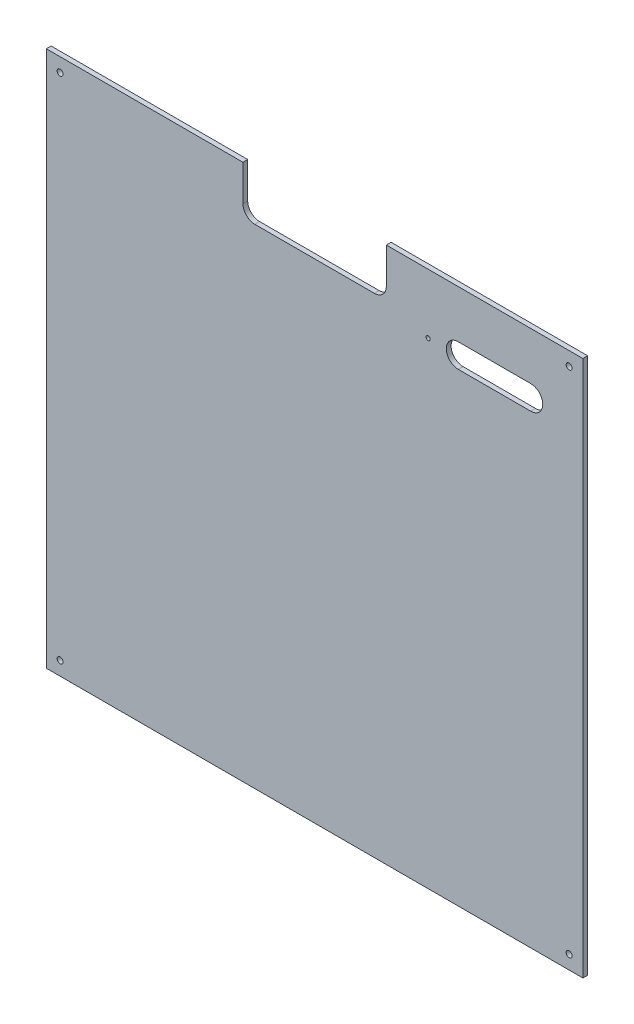
ISO-10303-21;
HEADER;
FILE_DESCRIPTION(('STEP AP214'),'2;1');
FILE_NAME('part.step','',(''),(''),'','','');
FILE_SCHEMA(('AUTOMOTIVE_DESIGN { 1 0 10303 214 1 1 1 1 }'));
ENDSEC;
DATA;
#1=APPLICATION_CONTEXT('core data for automotive mechanical design processes');
#2=APPLICATION_PROTOCOL_DEFINITION('international standard','automotive_design',2000,#1);
#3=PRODUCT_CONTEXT('',#1,'mechanical');
#4=PRODUCT('Part','Part','',(#3));
#5=PRODUCT_RELATED_PRODUCT_CATEGORY('part','',(#4));
#6=PRODUCT_DEFINITION_FORMATION('','',#4);
#7=PRODUCT_DEFINITION_CONTEXT('part definition',#1,'design');
#8=PRODUCT_DEFINITION('design','',#6,#7);
#9=PRODUCT_DEFINITION_SHAPE('','',#8);
#10=(LENGTH_UNIT() NAMED_UNIT(*) SI_UNIT(.MILLI.,.METRE.));
#11=(NAMED_UNIT(*) PLANE_ANGLE_UNIT() SI_UNIT($,.RADIAN.));
#12=(NAMED_UNIT(*) SI_UNIT($,.STERADIAN.) SOLID_ANGLE_UNIT());
#13=UNCERTAINTY_MEASURE_WITH_UNIT(LENGTH_MEASURE(1.E-05),#10,'distance_accuracy_value','');
#14=(GEOMETRIC_REPRESENTATION_CONTEXT(3) GLOBAL_UNCERTAINTY_ASSIGNED_CONTEXT((#13)) GLOBAL_UNIT_ASSIGNED_CONTEXT((#10,
#11,#12)) REPRESENTATION_CONTEXT('',''));
#15=CARTESIAN_POINT('',(0.,0.,0.));
#16=DIRECTION('',(0.,0.,1.));
#17=DIRECTION('',(1.,0.,0.));
#18=AXIS2_PLACEMENT_3D('',#15,#16,#17);
#19=CARTESIAN_POINT('',(174.5,419.,4.));
#20=DIRECTION('',(0.,0.,1.));
#21=DIRECTION('',(1.,0.,0.));
#22=AXIS2_PLACEMENT_3D('',#19,#20,#21);
#23=PLANE('',#22);
#24=DIRECTION('',(1.,0.,0.));
#25=VECTOR('',#24,1.);
#26=CARTESIAN_POINT('',(344.715899344631,389.,4.));
#27=LINE('',#26,#25);
#28=CARTESIAN_POINT('',(344.715899344631,389.,4.));
#29=VERTEX_POINT('',#28);
#30=CARTESIAN_POINT('',(405.440355678252,389.,4.));
#31=VERTEX_POINT('',#30);
#32=EDGE_CURVE('E146',#29,#31,#27,.T.);
#33=ORIENTED_EDGE('',*,*,#32,.F.);
#34=CARTESIAN_POINT('',(344.715899344631,399.,4.));
#35=DIRECTION('',(0.,0.,1.));
#36=DIRECTION('',(1.,0.,0.));
#37=AXIS2_PLACEMENT_3D('',#34,#35,#36);
#38=CIRCLE('',#37,10.);
#39=CARTESIAN_POINT('',(344.715899344631,409.,4.));
#40=VERTEX_POINT('',#39);
#41=EDGE_CURVE('E138',#40,#29,#38,.T.);
#42=ORIENTED_EDGE('',*,*,#41,.F.);
#43=DIRECTION('',(-1.,0.,0.));
#44=VECTOR('',#43,1.);
#45=CARTESIAN_POINT('',(344.715899344631,409.,4.));
#46=LINE('',#45,#44);
#47=CARTESIAN_POINT('',(405.440355678252,409.,4.));
#48=VERTEX_POINT('',#47);
#49=EDGE_CURVE('E161',#48,#40,#46,.T.);
#50=ORIENTED_EDGE('',*,*,#49,.F.);
#51=CARTESIAN_POINT('',(405.440355678252,399.,4.));
#52=DIRECTION('',(0.,0.,1.));
#53=DIRECTION('',(1.,0.,0.));
#54=AXIS2_PLACEMENT_3D('',#51,#52,#53);
#55=CIRCLE('',#54,10.);
#56=EDGE_CURVE('E159',#31,#48,#55,.T.);
#57=ORIENTED_EDGE('',*,*,#56,.F.);
#58=EDGE_LOOP('',(#33,#42,#50,#57));
#59=FACE_BOUND('',#58,.T.);
#60=CARTESIAN_POINT('',(11.5,437.5,4.));
#61=DIRECTION('',(0.,0.,1.));
#62=DIRECTION('',(-1.,0.,0.));
#63=AXIS2_PLACEMENT_3D('',#60,#61,#62);
#64=CIRCLE('',#63,2.5);
#65=CARTESIAN_POINT('',(9.,437.5,4.));
#66=VERTEX_POINT('',#65);
#67=EDGE_CURVE('E177',#66,#66,#64,.T.);
#68=ORIENTED_EDGE('',*,*,#67,.F.);
#69=EDGE_LOOP('',(#68));
#70=FACE_BOUND('',#69,.T.);
#71=CARTESIAN_POINT('',(437.5,11.5,4.));
#72=DIRECTION('',(0.,0.,1.));
#73=DIRECTION('',(-1.,0.,0.));
#74=AXIS2_PLACEMENT_3D('',#71,#72,#73);
#75=CIRCLE('',#74,2.49999999999997);
#76=CARTESIAN_POINT('',(435.,11.5,4.));
#77=VERTEX_POINT('',#76);
#78=EDGE_CURVE('E189',#77,#77,#75,.T.);
#79=ORIENTED_EDGE('',*,*,#78,.F.);
#80=EDGE_LOOP('',(#79));
#81=FACE_BOUND('',#80,.T.);
#82=DIRECTION('',(1.,0.,0.));
#83=VECTOR('',#82,1.);
#84=CARTESIAN_POINT('',(449.,0.,4.));
#85=LINE('',#84,#83);
#86=CARTESIAN_POINT('',(0.,0.,4.));
#87=VERTEX_POINT('',#86);
#88=CARTESIAN_POINT('',(449.,0.,4.));
#89=VERTEX_POINT('',#88);
#90=EDGE_CURVE('E201',#87,#89,#85,.T.);
#91=ORIENTED_EDGE('',*,*,#90,.T.);
#92=DIRECTION('',(0.,1.,0.));
#93=VECTOR('',#92,1.);
#94=CARTESIAN_POINT('',(449.,449.,4.));
#95=LINE('',#94,#93);
#96=CARTESIAN_POINT('',(449.,449.,4.));
#97=VERTEX_POINT('',#96);
#98=EDGE_CURVE('E204',#89,#97,#95,.T.);
#99=ORIENTED_EDGE('',*,*,#98,.T.);
#100=DIRECTION('',(-1.,0.,0.));
#101=VECTOR('',#100,1.);
#102=CARTESIAN_POINT('',(284.5,449.,4.));
#103=LINE('',#102,#101);
#104=CARTESIAN_POINT('',(284.5,449.,4.));
#105=VERTEX_POINT('',#104);
#106=EDGE_CURVE('E207',#97,#105,#103,.T.);
#107=ORIENTED_EDGE('',*,*,#106,.T.);
#108=DIRECTION('',(0.,-1.,0.));
#109=VECTOR('',#108,1.);
#110=CARTESIAN_POINT('',(284.5,419.,4.));
#111=LINE('',#110,#109);
#112=CARTESIAN_POINT('',(284.5,419.,4.));
#113=VERTEX_POINT('',#112);
#114=EDGE_CURVE('E209',#105,#113,#111,.T.);
#115=ORIENTED_EDGE('',*,*,#114,.T.);
#116=CARTESIAN_POINT('',(274.5,419.,4.));
#117=DIRECTION('',(0.,0.,-1.));
#118=DIRECTION('',(-1.,0.,0.));
#119=AXIS2_PLACEMENT_3D('',#116,#117,#118);
#120=CIRCLE('',#119,10.);
#121=CARTESIAN_POINT('',(274.5,409.,4.));
#122=VERTEX_POINT('',#121);
#123=EDGE_CURVE('E211',#113,#122,#120,.T.);
#124=ORIENTED_EDGE('',*,*,#123,.T.);
#125=DIRECTION('',(-1.,0.,0.));
#126=VECTOR('',#125,1.);
#127=CARTESIAN_POINT('',(174.5,409.,4.));
#128=LINE('',#127,#126);
#129=CARTESIAN_POINT('',(174.5,409.,4.));
#130=VERTEX_POINT('',#129);
#131=EDGE_CURVE('E213',#122,#130,#128,.T.);
#132=ORIENTED_EDGE('',*,*,#131,.T.);
#133=CARTESIAN_POINT('',(174.5,419.,4.));
#134=DIRECTION('',(0.,0.,-1.));
#135=DIRECTION('',(1.,0.,0.));
#136=AXIS2_PLACEMENT_3D('',#133,#134,#135);
#137=CIRCLE('',#136,10.);
#138=CARTESIAN_POINT('',(164.5,419.,4.));
#139=VERTEX_POINT('',#138);
#140=EDGE_CURVE('E215',#130,#139,#137,.T.);
#141=ORIENTED_EDGE('',*,*,#140,.T.);
#142=DIRECTION('',(0.,1.,0.));
#143=VECTOR('',#142,1.);
#144=CARTESIAN_POINT('',(164.5,449.,4.));
#145=LINE('',#144,#143);
#146=CARTESIAN_POINT('',(164.5,449.,4.));
#147=VERTEX_POINT('',#146);
#148=EDGE_CURVE('E217',#139,#147,#145,.T.);
#149=ORIENTED_EDGE('',*,*,#148,.T.);
#150=DIRECTION('',(-1.,0.,0.));
#151=VECTOR('',#150,1.);
#152=CARTESIAN_POINT('',(0.,449.,4.));
#153=LINE('',#152,#151);
#154=CARTESIAN_POINT('',(0.,449.,4.));
#155=VERTEX_POINT('',#154);
#156=EDGE_CURVE('E219',#147,#155,#153,.T.);
#157=ORIENTED_EDGE('',*,*,#156,.T.);
#158=DIRECTION('',(0.,-1.,0.));
#159=VECTOR('',#158,1.);
#160=CARTESIAN_POINT('',(0.,0.,4.));
#161=LINE('',#160,#159);
#162=EDGE_CURVE('E221',#155,#87,#161,.T.);
#163=ORIENTED_EDGE('',*,*,#162,.T.);
#164=EDGE_LOOP('',(#91,#99,#107,#115,#124,#132,#141,#149,#157,#163));
#165=FACE_BOUND('',#164,.T.);
#166=CARTESIAN_POINT('',(11.5,11.5,4.));
#167=DIRECTION('',(0.,0.,1.));
#168=DIRECTION('',(1.,0.,0.));
#169=AXIS2_PLACEMENT_3D('',#166,#167,#168);
#170=CIRCLE('',#169,2.5);
#171=CARTESIAN_POINT('',(14.,11.5,4.));
#172=VERTEX_POINT('',#171);
#173=EDGE_CURVE('E195',#172,#172,#170,.T.);
#174=ORIENTED_EDGE('',*,*,#173,.F.);
#175=EDGE_LOOP('',(#174));
#176=FACE_BOUND('',#175,.T.);
#177=CARTESIAN_POINT('',(437.5,437.5,4.));
#178=DIRECTION('',(0.,0.,1.));
#179=DIRECTION('',(1.,0.,0.));
#180=AXIS2_PLACEMENT_3D('',#177,#178,#179);
#181=CIRCLE('',#180,2.49999999999997);
#182=CARTESIAN_POINT('',(440.,437.5,4.));
#183=VERTEX_POINT('',#182);
#184=EDGE_CURVE('E183',#183,#183,#181,.T.);
#185=ORIENTED_EDGE('',*,*,#184,.F.);
#186=EDGE_LOOP('',(#185));
#187=FACE_BOUND('',#186,.T.);
#188=CARTESIAN_POINT('',(319.5,399.,4.));
#189=DIRECTION('',(0.,0.,1.));
#190=DIRECTION('',(1.,0.,0.));
#191=AXIS2_PLACEMENT_3D('',#188,#189,#190);
#192=CIRCLE('',#191,1.74999999999998);
#193=CARTESIAN_POINT('',(321.25,399.,4.));
#194=VERTEX_POINT('',#193);
#195=EDGE_CURVE('E167',#194,#194,#192,.T.);
#196=ORIENTED_EDGE('',*,*,#195,.F.);
#197=EDGE_LOOP('',(#196));
#198=FACE_BOUND('',#197,.T.);
#199=ADVANCED_FACE('F37',(#59,#70,#81,#165,#176,#187,#198),#23,.T.);
#200=CARTESIAN_POINT('',(174.5,419.,0.));
#201=DIRECTION('',(0.,0.,1.));
#202=DIRECTION('',(1.,0.,0.));
#203=AXIS2_PLACEMENT_3D('',#200,#201,#202);
#204=PLANE('',#203);
#205=CARTESIAN_POINT('',(11.5,437.5,0.));
#206=DIRECTION('',(0.,0.,1.));
#207=DIRECTION('',(-1.,0.,0.));
#208=AXIS2_PLACEMENT_3D('',#205,#206,#207);
#209=CIRCLE('',#208,2.5);
#210=CARTESIAN_POINT('',(9.,437.5,0.));
#211=VERTEX_POINT('',#210);
#212=EDGE_CURVE('E154',#211,#211,#209,.T.);
#213=ORIENTED_EDGE('',*,*,#212,.T.);
#214=EDGE_LOOP('',(#213));
#215=FACE_BOUND('',#214,.T.);
#216=CARTESIAN_POINT('',(437.5,437.5,0.));
#217=DIRECTION('',(0.,0.,1.));
#218=DIRECTION('',(1.,0.,0.));
#219=AXIS2_PLACEMENT_3D('',#216,#217,#218);
#220=CIRCLE('',#219,2.49999999999997);
#221=CARTESIAN_POINT('',(440.,437.5,0.));
#222=VERTEX_POINT('',#221);
#223=EDGE_CURVE('E180',#222,#222,#220,.T.);
#224=ORIENTED_EDGE('',*,*,#223,.T.);
#225=EDGE_LOOP('',(#224));
#226=FACE_BOUND('',#225,.T.);
#227=CARTESIAN_POINT('',(437.5,11.5,0.));
#228=DIRECTION('',(0.,0.,1.));
#229=DIRECTION('',(-1.,0.,0.));
#230=AXIS2_PLACEMENT_3D('',#227,#228,#229);
#231=CIRCLE('',#230,2.49999999999997);
#232=CARTESIAN_POINT('',(435.,11.5,0.));
#233=VERTEX_POINT('',#232);
#234=EDGE_CURVE('E186',#233,#233,#231,.T.);
#235=ORIENTED_EDGE('',*,*,#234,.T.);
#236=EDGE_LOOP('',(#235));
#237=FACE_BOUND('',#236,.T.);
#238=CARTESIAN_POINT('',(11.5,11.5,0.));
#239=DIRECTION('',(0.,0.,1.));
#240=DIRECTION('',(1.,0.,0.));
#241=AXIS2_PLACEMENT_3D('',#238,#239,#240);
#242=CIRCLE('',#241,2.5);
#243=CARTESIAN_POINT('',(14.,11.5,0.));
#244=VERTEX_POINT('',#243);
#245=EDGE_CURVE('E192',#244,#244,#242,.T.);
#246=ORIENTED_EDGE('',*,*,#245,.T.);
#247=EDGE_LOOP('',(#246));
#248=FACE_BOUND('',#247,.T.);
#249=DIRECTION('',(1.,0.,0.));
#250=VECTOR('',#249,1.);
#251=CARTESIAN_POINT('',(449.,0.,0.));
#252=LINE('',#251,#250);
#253=CARTESIAN_POINT('',(0.,0.,0.));
#254=VERTEX_POINT('',#253);
#255=CARTESIAN_POINT('',(449.,0.,0.));
#256=VERTEX_POINT('',#255);
#257=EDGE_CURVE('E198',#254,#256,#252,.T.);
#258=ORIENTED_EDGE('',*,*,#257,.F.);
#259=DIRECTION('',(0.,-1.,0.));
#260=VECTOR('',#259,1.);
#261=CARTESIAN_POINT('',(0.,0.,0.));
#262=LINE('',#261,#260);
#263=CARTESIAN_POINT('',(0.,449.,0.));
#264=VERTEX_POINT('',#263);
#265=EDGE_CURVE('E205',#264,#254,#262,.T.);
#266=ORIENTED_EDGE('',*,*,#265,.F.);
#267=DIRECTION('',(-1.,0.,0.));
#268=VECTOR('',#267,1.);
#269=CARTESIAN_POINT('',(0.,449.,0.));
#270=LINE('',#269,#268);
#271=CARTESIAN_POINT('',(164.5,449.,0.));
#272=VERTEX_POINT('',#271);
#273=EDGE_CURVE('E240',#272,#264,#270,.T.);
#274=ORIENTED_EDGE('',*,*,#273,.F.);
#275=DIRECTION('',(0.,1.,0.));
#276=VECTOR('',#275,1.);
#277=CARTESIAN_POINT('',(164.5,449.,0.));
#278=LINE('',#277,#276);
#279=CARTESIAN_POINT('',(164.5,419.,0.));
#280=VERTEX_POINT('',#279);
#281=EDGE_CURVE('E238',#280,#272,#278,.T.);
#282=ORIENTED_EDGE('',*,*,#281,.F.);
#283=CARTESIAN_POINT('',(174.5,419.,0.));
#284=DIRECTION('',(0.,0.,-1.));
#285=DIRECTION('',(1.,0.,0.));
#286=AXIS2_PLACEMENT_3D('',#283,#284,#285);
#287=CIRCLE('',#286,10.);
#288=CARTESIAN_POINT('',(174.5,409.,0.));
#289=VERTEX_POINT('',#288);
#290=EDGE_CURVE('E236',#289,#280,#287,.T.);
#291=ORIENTED_EDGE('',*,*,#290,.F.);
#292=DIRECTION('',(-1.,0.,0.));
#293=VECTOR('',#292,1.);
#294=CARTESIAN_POINT('',(174.5,409.,0.));
#295=LINE('',#294,#293);
#296=CARTESIAN_POINT('',(274.5,409.,0.));
#297=VERTEX_POINT('',#296);
#298=EDGE_CURVE('E234',#297,#289,#295,.T.);
#299=ORIENTED_EDGE('',*,*,#298,.F.);
#300=CARTESIAN_POINT('',(274.5,419.,0.));
#301=DIRECTION('',(0.,0.,-1.));
#302=DIRECTION('',(-1.,0.,0.));
#303=AXIS2_PLACEMENT_3D('',#300,#301,#302);
#304=CIRCLE('',#303,10.);
#305=CARTESIAN_POINT('',(284.5,419.,0.));
#306=VERTEX_POINT('',#305);
#307=EDGE_CURVE('E232',#306,#297,#304,.T.);
#308=ORIENTED_EDGE('',*,*,#307,.F.);
#309=DIRECTION('',(0.,-1.,0.));
#310=VECTOR('',#309,1.);
#311=CARTESIAN_POINT('',(284.5,419.,0.));
#312=LINE('',#311,#310);
#313=CARTESIAN_POINT('',(284.5,449.,0.));
#314=VERTEX_POINT('',#313);
#315=EDGE_CURVE('E230',#314,#306,#312,.T.);
#316=ORIENTED_EDGE('',*,*,#315,.F.);
#317=DIRECTION('',(-1.,0.,0.));
#318=VECTOR('',#317,1.);
#319=CARTESIAN_POINT('',(284.5,449.,0.));
#320=LINE('',#319,#318);
#321=CARTESIAN_POINT('',(449.,449.,0.));
#322=VERTEX_POINT('',#321);
#323=EDGE_CURVE('E228',#322,#314,#320,.T.);
#324=ORIENTED_EDGE('',*,*,#323,.F.);
#325=DIRECTION('',(0.,1.,0.));
#326=VECTOR('',#325,1.);
#327=CARTESIAN_POINT('',(449.,449.,0.));
#328=LINE('',#327,#326);
#329=EDGE_CURVE('E226',#256,#322,#328,.T.);
#330=ORIENTED_EDGE('',*,*,#329,.F.);
#331=EDGE_LOOP('',(#258,#266,#274,#282,#291,#299,#308,#316,#324,#330));
#332=FACE_BOUND('',#331,.T.);
#333=CARTESIAN_POINT('',(344.715899344631,399.,0.));
#334=DIRECTION('',(0.,0.,1.));
#335=DIRECTION('',(1.,0.,0.));
#336=AXIS2_PLACEMENT_3D('',#333,#334,#335);
#337=CIRCLE('',#336,10.);
#338=CARTESIAN_POINT('',(344.715899344631,409.,0.));
#339=VERTEX_POINT('',#338);
#340=CARTESIAN_POINT('',(344.715899344631,389.,0.));
#341=VERTEX_POINT('',#340);
#342=EDGE_CURVE('E60',#339,#341,#337,.T.);
#343=ORIENTED_EDGE('',*,*,#342,.T.);
#344=DIRECTION('',(1.,0.,0.));
#345=VECTOR('',#344,1.);
#346=CARTESIAN_POINT('',(344.715899344631,389.,0.));
#347=LINE('',#346,#345);
#348=CARTESIAN_POINT('',(405.440355678252,389.,0.));
#349=VERTEX_POINT('',#348);
#350=EDGE_CURVE('E153',#341,#349,#347,.T.);
#351=ORIENTED_EDGE('',*,*,#350,.T.);
#352=CARTESIAN_POINT('',(405.440355678252,399.,0.));
#353=DIRECTION('',(0.,0.,1.));
#354=DIRECTION('',(1.,0.,0.));
#355=AXIS2_PLACEMENT_3D('',#352,#353,#354);
#356=CIRCLE('',#355,10.);
#357=CARTESIAN_POINT('',(405.440355678252,409.,0.));
#358=VERTEX_POINT('',#357);
#359=EDGE_CURVE('E169',#349,#358,#356,.T.);
#360=ORIENTED_EDGE('',*,*,#359,.T.);
#361=DIRECTION('',(-1.,0.,0.));
#362=VECTOR('',#361,1.);
#363=CARTESIAN_POINT('',(344.715899344631,409.,0.));
#364=LINE('',#363,#362);
#365=EDGE_CURVE('E147',#358,#339,#364,.T.);
#366=ORIENTED_EDGE('',*,*,#365,.T.);
#367=EDGE_LOOP('',(#343,#351,#360,#366));
#368=FACE_BOUND('',#367,.T.);
#369=CARTESIAN_POINT('',(319.5,399.,0.));
#370=DIRECTION('',(0.,0.,1.));
#371=DIRECTION('',(1.,0.,0.));
#372=AXIS2_PLACEMENT_3D('',#369,#370,#371);
#373=CIRCLE('',#372,1.74999999999998);
#374=CARTESIAN_POINT('',(321.25,399.,0.));
#375=VERTEX_POINT('',#374);
#376=EDGE_CURVE('E505',#375,#375,#373,.T.);
#377=ORIENTED_EDGE('',*,*,#376,.T.);
#378=EDGE_LOOP('',(#377));
#379=FACE_BOUND('',#378,.T.);
#380=ADVANCED_FACE('F276',(#215,#226,#237,#248,#332,#368,#379),#204,.F.);
#381=CARTESIAN_POINT('',(449.,0.,4.));
#382=DIRECTION('',(0.,1.,0.));
#383=DIRECTION('',(0.,0.,1.));
#384=AXIS2_PLACEMENT_3D('',#381,#382,#383);
#385=PLANE('',#384);
#386=ORIENTED_EDGE('',*,*,#257,.T.);
#387=DIRECTION('',(0.,0.,-1.));
#388=VECTOR('',#387,1.);
#389=CARTESIAN_POINT('',(449.,0.,4.));
#390=LINE('',#389,#388);
#391=EDGE_CURVE('E11',#89,#256,#390,.T.);
#392=ORIENTED_EDGE('',*,*,#391,.F.);
#393=ORIENTED_EDGE('',*,*,#90,.F.);
#394=DIRECTION('',(0.,0.,-1.));
#395=VECTOR('',#394,1.);
#396=CARTESIAN_POINT('',(0.,0.,4.));
#397=LINE('',#396,#395);
#398=EDGE_CURVE('E223',#87,#254,#397,.T.);
#399=ORIENTED_EDGE('',*,*,#398,.T.);
#400=EDGE_LOOP('',(#386,#392,#393,#399));
#401=FACE_BOUND('',#400,.T.);
#402=ADVANCED_FACE('F39',(#401),#385,.F.);
#403=CARTESIAN_POINT('',(449.,449.,4.));
#404=DIRECTION('',(-1.,0.,0.));
#405=DIRECTION('',(0.,-1.,0.));
#406=AXIS2_PLACEMENT_3D('',#403,#404,#405);
#407=PLANE('',#406);
#408=ORIENTED_EDGE('',*,*,#329,.T.);
#409=DIRECTION('',(0.,0.,-1.));
#410=VECTOR('',#409,1.);
#411=CARTESIAN_POINT('',(449.,449.,4.));
#412=LINE('',#411,#410);
#413=EDGE_CURVE('E45',#97,#322,#412,.T.);
#414=ORIENTED_EDGE('',*,*,#413,.F.);
#415=ORIENTED_EDGE('',*,*,#98,.F.);
#416=ORIENTED_EDGE('',*,*,#391,.T.);
#417=EDGE_LOOP('',(#408,#414,#415,#416));
#418=FACE_BOUND('',#417,.T.);
#419=ADVANCED_FACE('F294',(#418),#407,.F.);
#420=CARTESIAN_POINT('',(284.5,449.,4.));
#421=DIRECTION('',(0.,-1.,0.));
#422=DIRECTION('',(0.,0.,-1.));
#423=AXIS2_PLACEMENT_3D('',#420,#421,#422);
#424=PLANE('',#423);
#425=ORIENTED_EDGE('',*,*,#323,.T.);
#426=DIRECTION('',(0.,0.,-1.));
#427=VECTOR('',#426,1.);
#428=CARTESIAN_POINT('',(284.5,449.,4.));
#429=LINE('',#428,#427);
#430=EDGE_CURVE('E263',#105,#314,#429,.T.);
#431=ORIENTED_EDGE('',*,*,#430,.F.);
#432=ORIENTED_EDGE('',*,*,#106,.F.);
#433=ORIENTED_EDGE('',*,*,#413,.T.);
#434=EDGE_LOOP('',(#425,#431,#432,#433));
#435=FACE_BOUND('',#434,.T.);
#436=ADVANCED_FACE('F270',(#435),#424,.F.);
#437=CARTESIAN_POINT('',(284.5,419.,4.));
#438=DIRECTION('',(1.,0.,0.));
#439=DIRECTION('',(0.,0.,-1.));
#440=AXIS2_PLACEMENT_3D('',#437,#438,#439);
#441=PLANE('',#440);
#442=ORIENTED_EDGE('',*,*,#315,.T.);
#443=DIRECTION('',(0.,0.,-1.));
#444=VECTOR('',#443,1.);
#445=CARTESIAN_POINT('',(284.5,419.,4.));
#446=LINE('',#445,#444);
#447=EDGE_CURVE('E260',#113,#306,#446,.T.);
#448=ORIENTED_EDGE('',*,*,#447,.F.);
#449=ORIENTED_EDGE('',*,*,#114,.F.);
#450=ORIENTED_EDGE('',*,*,#430,.T.);
#451=EDGE_LOOP('',(#442,#448,#449,#450));
#452=FACE_BOUND('',#451,.T.);
#453=ADVANCED_FACE('F282',(#452),#441,.F.);
#454=CARTESIAN_POINT('',(274.5,419.,4.));
#455=DIRECTION('',(0.,0.,-1.));
#456=DIRECTION('',(-1.,0.,0.));
#457=AXIS2_PLACEMENT_3D('',#454,#455,#456);
#458=CYLINDRICAL_SURFACE('',#457,10.);
#459=ORIENTED_EDGE('',*,*,#307,.T.);
#460=DIRECTION('',(0.,0.,-1.));
#461=VECTOR('',#460,1.);
#462=CARTESIAN_POINT('',(274.5,409.,4.));
#463=LINE('',#462,#461);
#464=EDGE_CURVE('E257',#122,#297,#463,.T.);
#465=ORIENTED_EDGE('',*,*,#464,.F.);
#466=ORIENTED_EDGE('',*,*,#123,.F.);
#467=ORIENTED_EDGE('',*,*,#447,.T.);
#468=EDGE_LOOP('',(#459,#465,#466,#467));
#469=FACE_BOUND('',#468,.T.);
#470=ADVANCED_FACE('F286',(#469),#458,.F.);
#471=CARTESIAN_POINT('',(174.5,409.,4.));
#472=DIRECTION('',(0.,-1.,0.));
#473=DIRECTION('',(0.,0.,-1.));
#474=AXIS2_PLACEMENT_3D('',#471,#472,#473);
#475=PLANE('',#474);
#476=ORIENTED_EDGE('',*,*,#298,.T.);
#477=DIRECTION('',(0.,0.,-1.));
#478=VECTOR('',#477,1.);
#479=CARTESIAN_POINT('',(174.5,409.,4.));
#480=LINE('',#479,#478);
#481=EDGE_CURVE('E254',#130,#289,#480,.T.);
#482=ORIENTED_EDGE('',*,*,#481,.F.);
#483=ORIENTED_EDGE('',*,*,#131,.F.);
#484=ORIENTED_EDGE('',*,*,#464,.T.);
#485=EDGE_LOOP('',(#476,#482,#483,#484));
#486=FACE_BOUND('',#485,.T.);
#487=ADVANCED_FACE('F317',(#486),#475,.F.);
#488=CARTESIAN_POINT('',(174.5,419.,4.));
#489=DIRECTION('',(0.,0.,-1.));
#490=DIRECTION('',(-1.,0.,0.));
#491=AXIS2_PLACEMENT_3D('',#488,#489,#490);
#492=CYLINDRICAL_SURFACE('',#491,10.);
#493=ORIENTED_EDGE('',*,*,#290,.T.);
#494=DIRECTION('',(0.,0.,-1.));
#495=VECTOR('',#494,1.);
#496=CARTESIAN_POINT('',(164.5,419.,4.));
#497=LINE('',#496,#495);
#498=EDGE_CURVE('E251',#139,#280,#497,.T.);
#499=ORIENTED_EDGE('',*,*,#498,.F.);
#500=ORIENTED_EDGE('',*,*,#140,.F.);
#501=ORIENTED_EDGE('',*,*,#481,.T.);
#502=EDGE_LOOP('',(#493,#499,#500,#501));
#503=FACE_BOUND('',#502,.T.);
#504=ADVANCED_FACE('F314',(#503),#492,.F.);
#505=CARTESIAN_POINT('',(164.5,449.,4.));
#506=DIRECTION('',(-1.,0.,0.));
#507=DIRECTION('',(0.,0.,1.));
#508=AXIS2_PLACEMENT_3D('',#505,#506,#507);
#509=PLANE('',#508);
#510=ORIENTED_EDGE('',*,*,#281,.T.);
#511=DIRECTION('',(0.,0.,-1.));
#512=VECTOR('',#511,1.);
#513=CARTESIAN_POINT('',(164.5,449.,4.));
#514=LINE('',#513,#512);
#515=EDGE_CURVE('E248',#147,#272,#514,.T.);
#516=ORIENTED_EDGE('',*,*,#515,.F.);
#517=ORIENTED_EDGE('',*,*,#148,.F.);
#518=ORIENTED_EDGE('',*,*,#498,.T.);
#519=EDGE_LOOP('',(#510,#516,#517,#518));
#520=FACE_BOUND('',#519,.T.);
#521=ADVANCED_FACE('F310',(#520),#509,.F.);
#522=CARTESIAN_POINT('',(0.,449.,4.));
#523=DIRECTION('',(0.,-1.,0.));
#524=DIRECTION('',(0.,0.,-1.));
#525=AXIS2_PLACEMENT_3D('',#522,#523,#524);
#526=PLANE('',#525);
#527=ORIENTED_EDGE('',*,*,#273,.T.);
#528=DIRECTION('',(0.,0.,-1.));
#529=VECTOR('',#528,1.);
#530=CARTESIAN_POINT('',(0.,449.,4.));
#531=LINE('',#530,#529);
#532=EDGE_CURVE('E245',#155,#264,#531,.T.);
#533=ORIENTED_EDGE('',*,*,#532,.F.);
#534=ORIENTED_EDGE('',*,*,#156,.F.);
#535=ORIENTED_EDGE('',*,*,#515,.T.);
#536=EDGE_LOOP('',(#527,#533,#534,#535));
#537=FACE_BOUND('',#536,.T.);
#538=ADVANCED_FACE('F306',(#537),#526,.F.);
#539=CARTESIAN_POINT('',(0.,0.,4.));
#540=DIRECTION('',(1.,0.,0.));
#541=DIRECTION('',(0.,0.,-1.));
#542=AXIS2_PLACEMENT_3D('',#539,#540,#541);
#543=PLANE('',#542);
#544=ORIENTED_EDGE('',*,*,#265,.T.);
#545=ORIENTED_EDGE('',*,*,#398,.F.);
#546=ORIENTED_EDGE('',*,*,#162,.F.);
#547=ORIENTED_EDGE('',*,*,#532,.T.);
#548=EDGE_LOOP('',(#544,#545,#546,#547));
#549=FACE_BOUND('',#548,.T.);
#550=ADVANCED_FACE('F301',(#549),#543,.F.);
#551=CARTESIAN_POINT('',(11.5,11.5,4.));
#552=DIRECTION('',(0.,0.,-1.));
#553=DIRECTION('',(-1.,0.,0.));
#554=AXIS2_PLACEMENT_3D('',#551,#552,#553);
#555=CYLINDRICAL_SURFACE('',#554,2.5);
#556=ORIENTED_EDGE('',*,*,#173,.T.);
#557=EDGE_LOOP('',(#556));
#558=FACE_BOUND('',#557,.T.);
#559=ORIENTED_EDGE('',*,*,#245,.F.);
#560=EDGE_LOOP('',(#559));
#561=FACE_BOUND('',#560,.T.);
#562=ADVANCED_FACE('F334',(#558,#561),#555,.F.);
#563=CARTESIAN_POINT('',(437.5,11.5,4.));
#564=DIRECTION('',(0.,0.,-1.));
#565=DIRECTION('',(-1.,0.,0.));
#566=AXIS2_PLACEMENT_3D('',#563,#564,#565);
#567=CYLINDRICAL_SURFACE('',#566,2.49999999999997);
#568=ORIENTED_EDGE('',*,*,#78,.T.);
#569=EDGE_LOOP('',(#568));
#570=FACE_BOUND('',#569,.T.);
#571=ORIENTED_EDGE('',*,*,#234,.F.);
#572=EDGE_LOOP('',(#571));
#573=FACE_BOUND('',#572,.T.);
#574=ADVANCED_FACE('F360',(#570,#573),#567,.F.);
#575=CARTESIAN_POINT('',(437.5,437.5,4.));
#576=DIRECTION('',(0.,0.,-1.));
#577=DIRECTION('',(-1.,0.,0.));
#578=AXIS2_PLACEMENT_3D('',#575,#576,#577);
#579=CYLINDRICAL_SURFACE('',#578,2.49999999999997);
#580=ORIENTED_EDGE('',*,*,#184,.T.);
#581=EDGE_LOOP('',(#580));
#582=FACE_BOUND('',#581,.T.);
#583=ORIENTED_EDGE('',*,*,#223,.F.);
#584=EDGE_LOOP('',(#583));
#585=FACE_BOUND('',#584,.T.);
#586=ADVANCED_FACE('F367',(#582,#585),#579,.F.);
#587=CARTESIAN_POINT('',(11.5,437.5,4.));
#588=DIRECTION('',(0.,0.,-1.));
#589=DIRECTION('',(-1.,0.,0.));
#590=AXIS2_PLACEMENT_3D('',#587,#588,#589);
#591=CYLINDRICAL_SURFACE('',#590,2.5);
#592=ORIENTED_EDGE('',*,*,#67,.T.);
#593=EDGE_LOOP('',(#592));
#594=FACE_BOUND('',#593,.T.);
#595=ORIENTED_EDGE('',*,*,#212,.F.);
#596=EDGE_LOOP('',(#595));
#597=FACE_BOUND('',#596,.T.);
#598=ADVANCED_FACE('F374',(#594,#597),#591,.F.);
#599=CARTESIAN_POINT('',(344.715899344631,399.,4.));
#600=DIRECTION('',(0.,0.,-1.));
#601=DIRECTION('',(-1.,0.,0.));
#602=AXIS2_PLACEMENT_3D('',#599,#600,#601);
#603=CYLINDRICAL_SURFACE('',#602,10.);
#604=ORIENTED_EDGE('',*,*,#342,.F.);
#605=DIRECTION('',(0.,0.,-1.));
#606=VECTOR('',#605,1.);
#607=CARTESIAN_POINT('',(344.715899344631,409.,4.));
#608=LINE('',#607,#606);
#609=EDGE_CURVE('E142',#40,#339,#608,.T.);
#610=ORIENTED_EDGE('',*,*,#609,.F.);
#611=ORIENTED_EDGE('',*,*,#41,.T.);
#612=DIRECTION('',(0.,0.,-1.));
#613=VECTOR('',#612,1.);
#614=CARTESIAN_POINT('',(344.715899344631,389.,4.));
#615=LINE('',#614,#613);
#616=EDGE_CURVE('E141',#29,#341,#615,.T.);
#617=ORIENTED_EDGE('',*,*,#616,.T.);
#618=EDGE_LOOP('',(#604,#610,#611,#617));
#619=FACE_BOUND('',#618,.T.);
#620=ADVANCED_FACE('F140',(#619),#603,.F.);
#621=CARTESIAN_POINT('',(344.715899344631,389.,4.));
#622=DIRECTION('',(0.,1.,0.));
#623=DIRECTION('',(0.,0.,1.));
#624=AXIS2_PLACEMENT_3D('',#621,#622,#623);
#625=PLANE('',#624);
#626=ORIENTED_EDGE('',*,*,#350,.F.);
#627=ORIENTED_EDGE('',*,*,#616,.F.);
#628=ORIENTED_EDGE('',*,*,#32,.T.);
#629=DIRECTION('',(0.,0.,-1.));
#630=VECTOR('',#629,1.);
#631=CARTESIAN_POINT('',(405.440355678252,389.,4.));
#632=LINE('',#631,#630);
#633=EDGE_CURVE('E155',#31,#349,#632,.T.);
#634=ORIENTED_EDGE('',*,*,#633,.T.);
#635=EDGE_LOOP('',(#626,#627,#628,#634));
#636=FACE_BOUND('',#635,.T.);
#637=ADVANCED_FACE('F150',(#636),#625,.T.);
#638=CARTESIAN_POINT('',(405.440355678252,399.,4.));
#639=DIRECTION('',(0.,0.,-1.));
#640=DIRECTION('',(-1.,0.,0.));
#641=AXIS2_PLACEMENT_3D('',#638,#639,#640);
#642=CYLINDRICAL_SURFACE('',#641,10.);
#643=ORIENTED_EDGE('',*,*,#359,.F.);
#644=ORIENTED_EDGE('',*,*,#633,.F.);
#645=ORIENTED_EDGE('',*,*,#56,.T.);
#646=DIRECTION('',(0.,0.,-1.));
#647=VECTOR('',#646,1.);
#648=CARTESIAN_POINT('',(405.440355678252,409.,4.));
#649=LINE('',#648,#647);
#650=EDGE_CURVE('E52',#48,#358,#649,.T.);
#651=ORIENTED_EDGE('',*,*,#650,.T.);
#652=EDGE_LOOP('',(#643,#644,#645,#651));
#653=FACE_BOUND('',#652,.T.);
#654=ADVANCED_FACE('F395',(#653),#642,.F.);
#655=CARTESIAN_POINT('',(344.715899344631,409.,4.));
#656=DIRECTION('',(0.,-1.,0.));
#657=DIRECTION('',(0.,0.,-1.));
#658=AXIS2_PLACEMENT_3D('',#655,#656,#657);
#659=PLANE('',#658);
#660=ORIENTED_EDGE('',*,*,#365,.F.);
#661=ORIENTED_EDGE('',*,*,#650,.F.);
#662=ORIENTED_EDGE('',*,*,#49,.T.);
#663=ORIENTED_EDGE('',*,*,#609,.T.);
#664=EDGE_LOOP('',(#660,#661,#662,#663));
#665=FACE_BOUND('',#664,.T.);
#666=ADVANCED_FACE('F402',(#665),#659,.T.);
#667=CARTESIAN_POINT('',(319.5,399.,4.));
#668=DIRECTION('',(0.,0.,-1.));
#669=DIRECTION('',(-1.,0.,0.));
#670=AXIS2_PLACEMENT_3D('',#667,#668,#669);
#671=CYLINDRICAL_SURFACE('',#670,1.74999999999998);
#672=ORIENTED_EDGE('',*,*,#195,.T.);
#673=EDGE_LOOP('',(#672));
#674=FACE_BOUND('',#673,.T.);
#675=ORIENTED_EDGE('',*,*,#376,.F.);
#676=EDGE_LOOP('',(#675));
#677=FACE_BOUND('',#676,.T.);
#678=ADVANCED_FACE('F410',(#674,#677),#671,.F.);
#679=CLOSED_SHELL('',(#199,#380,#402,#419,#436,#453,#470,#487,#504,#521,#538,#550,#562,#574,
#586,#598,#620,#637,#654,#666,#678));
#680=MANIFOLD_SOLID_BREP('B2',#679);
#681=ADVANCED_BREP_SHAPE_REPRESENTATION('',(#18,#680),#14);
#682=SHAPE_DEFINITION_REPRESENTATION(#9,#681);
ENDSEC;
END-ISO-10303-21;
